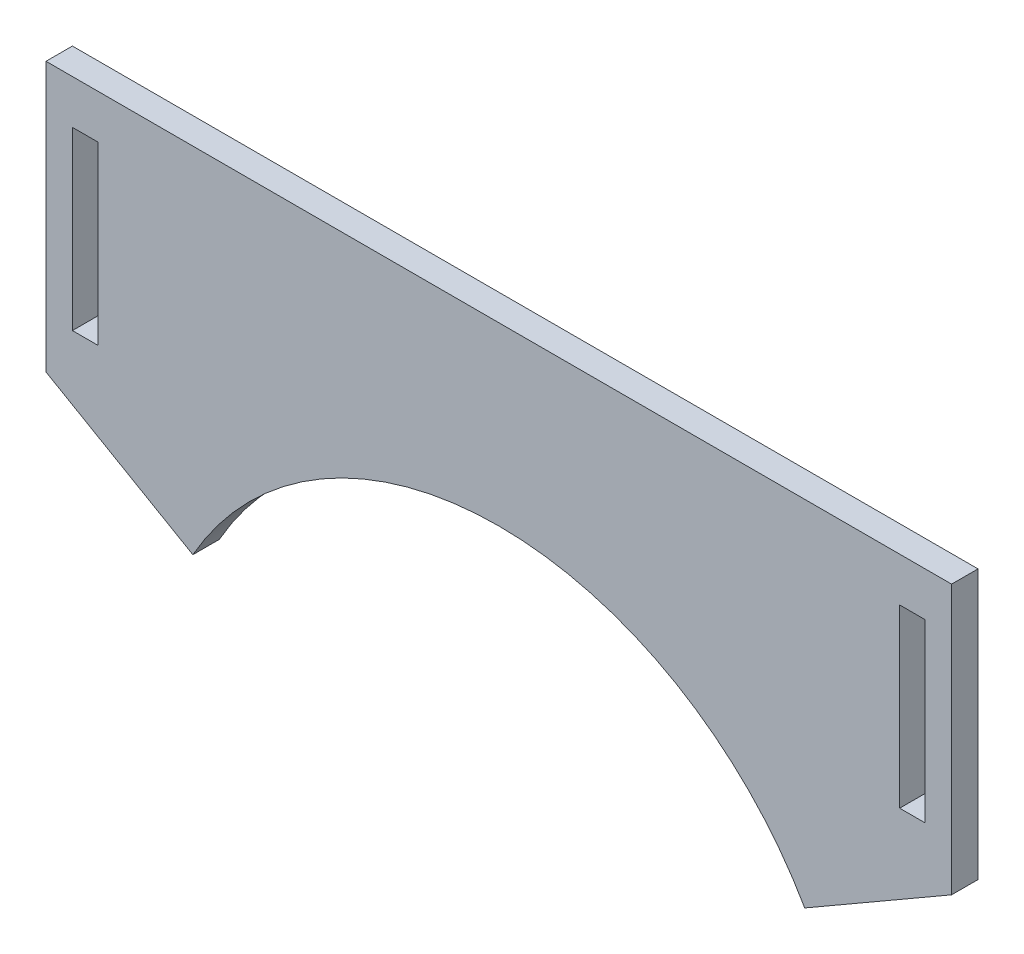
ISO-10303-21;
HEADER;
FILE_DESCRIPTION(('STEP AP214'),'2;1');
FILE_NAME('part.step','',(''),(''),'','','');
FILE_SCHEMA(('AUTOMOTIVE_DESIGN { 1 0 10303 214 1 1 1 1 }'));
ENDSEC;
DATA;
#1=APPLICATION_CONTEXT('core data for automotive mechanical design processes');
#2=APPLICATION_PROTOCOL_DEFINITION('international standard','automotive_design',2000,#1);
#3=PRODUCT_CONTEXT('',#1,'mechanical');
#4=PRODUCT('Part','Part','',(#3));
#5=PRODUCT_RELATED_PRODUCT_CATEGORY('part','',(#4));
#6=PRODUCT_DEFINITION_FORMATION('','',#4);
#7=PRODUCT_DEFINITION_CONTEXT('part definition',#1,'design');
#8=PRODUCT_DEFINITION('design','',#6,#7);
#9=PRODUCT_DEFINITION_SHAPE('','',#8);
#10=(LENGTH_UNIT() NAMED_UNIT(*) SI_UNIT(.MILLI.,.METRE.));
#11=(NAMED_UNIT(*) PLANE_ANGLE_UNIT() SI_UNIT($,.RADIAN.));
#12=(NAMED_UNIT(*) SI_UNIT($,.STERADIAN.) SOLID_ANGLE_UNIT());
#13=UNCERTAINTY_MEASURE_WITH_UNIT(LENGTH_MEASURE(1.E-05),#10,'distance_accuracy_value','');
#14=(GEOMETRIC_REPRESENTATION_CONTEXT(3) GLOBAL_UNCERTAINTY_ASSIGNED_CONTEXT((#13)) GLOBAL_UNIT_ASSIGNED_CONTEXT((#10,
#11,#12)) REPRESENTATION_CONTEXT('',''));
#15=CARTESIAN_POINT('',(0.,0.,0.));
#16=DIRECTION('',(0.,0.,1.));
#17=DIRECTION('',(1.,0.,0.));
#18=AXIS2_PLACEMENT_3D('',#15,#16,#17);
#19=CARTESIAN_POINT('',(52.45,-60.,3.));
#20=DIRECTION('',(0.,0.,1.));
#21=DIRECTION('',(1.,0.,0.));
#22=AXIS2_PLACEMENT_3D('',#19,#20,#21);
#23=PLANE('',#22);
#24=DIRECTION('',(0.,-1.,0.));
#25=VECTOR('',#24,1.);
#26=CARTESIAN_POINT('',(103.9,0.,3.));
#27=LINE('',#26,#25);
#28=CARTESIAN_POINT('',(103.9,0.,3.));
#29=VERTEX_POINT('',#28);
#30=CARTESIAN_POINT('',(103.9,-30.5773502691896,3.));
#31=VERTEX_POINT('',#30);
#32=EDGE_CURVE('E135',#29,#31,#27,.T.);
#33=ORIENTED_EDGE('',*,*,#32,.F.);
#34=DIRECTION('',(-1.,0.,0.));
#35=VECTOR('',#34,1.);
#36=CARTESIAN_POINT('',(0.,0.,3.));
#37=LINE('',#36,#35);
#38=CARTESIAN_POINT('',(1.,0.,3.));
#39=VERTEX_POINT('',#38);
#40=EDGE_CURVE('E55',#29,#39,#37,.T.);
#41=ORIENTED_EDGE('',*,*,#40,.T.);
#42=DIRECTION('',(0.,1.,0.));
#43=VECTOR('',#42,1.);
#44=CARTESIAN_POINT('',(1.,0.,3.));
#45=LINE('',#44,#43);
#46=CARTESIAN_POINT('',(1.,-30.5773502691896,3.));
#47=VERTEX_POINT('',#46);
#48=EDGE_CURVE('E140',#47,#39,#45,.T.);
#49=ORIENTED_EDGE('',*,*,#48,.F.);
#50=DIRECTION('',(0.86602540378444,-0.499999999999998,0.));
#51=VECTOR('',#50,1.);
#52=CARTESIAN_POINT('',(0.,-30.,3.));
#53=LINE('',#52,#51);
#54=CARTESIAN_POINT('',(17.687510664822,-40.2118890436293,3.));
#55=VERTEX_POINT('',#54);
#56=EDGE_CURVE('E158',#47,#55,#53,.T.);
#57=ORIENTED_EDGE('',*,*,#56,.T.);
#58=CARTESIAN_POINT('',(52.45,-60.,3.));
#59=DIRECTION('',(0.,0.,-1.));
#60=DIRECTION('',(1.,0.,0.));
#61=AXIS2_PLACEMENT_3D('',#58,#59,#60);
#62=CIRCLE('',#61,40.);
#63=CARTESIAN_POINT('',(87.212489335178,-40.2118890436293,3.));
#64=VERTEX_POINT('',#63);
#65=EDGE_CURVE('E165',#55,#64,#62,.T.);
#66=ORIENTED_EDGE('',*,*,#65,.T.);
#67=DIRECTION('',(0.86602540378444,0.499999999999998,0.));
#68=VECTOR('',#67,1.);
#69=CARTESIAN_POINT('',(104.9,-30.,3.));
#70=LINE('',#69,#68);
#71=EDGE_CURVE('E163',#64,#31,#70,.T.);
#72=ORIENTED_EDGE('',*,*,#71,.T.);
#73=EDGE_LOOP('',(#33,#41,#49,#57,#66,#72));
#74=FACE_BOUND('',#73,.T.);
#75=DIRECTION('',(1.,0.,0.));
#76=VECTOR('',#75,1.);
#77=CARTESIAN_POINT('',(98.0000000000001,-24.9999999999999,3.));
#78=LINE('',#77,#76);
#79=CARTESIAN_POINT('',(98.0000000000001,-24.9999999999999,3.));
#80=VERTEX_POINT('',#79);
#81=CARTESIAN_POINT('',(100.9,-24.9999999999999,3.));
#82=VERTEX_POINT('',#81);
#83=EDGE_CURVE('E234',#80,#82,#78,.T.);
#84=ORIENTED_EDGE('',*,*,#83,.F.);
#85=DIRECTION('',(0.,-1.,0.));
#86=VECTOR('',#85,1.);
#87=CARTESIAN_POINT('',(98.0000000000001,-5.,3.));
#88=LINE('',#87,#86);
#89=CARTESIAN_POINT('',(98.0000000000001,-5.,3.));
#90=VERTEX_POINT('',#89);
#91=EDGE_CURVE('E232',#90,#80,#88,.T.);
#92=ORIENTED_EDGE('',*,*,#91,.F.);
#93=DIRECTION('',(-1.,0.,0.));
#94=VECTOR('',#93,1.);
#95=CARTESIAN_POINT('',(98.0000000000001,-5.,3.));
#96=LINE('',#95,#94);
#97=CARTESIAN_POINT('',(100.9,-5.,3.));
#98=VERTEX_POINT('',#97);
#99=EDGE_CURVE('E240',#98,#90,#96,.T.);
#100=ORIENTED_EDGE('',*,*,#99,.F.);
#101=DIRECTION('',(0.,1.,0.));
#102=VECTOR('',#101,1.);
#103=CARTESIAN_POINT('',(100.9,-5.,3.));
#104=LINE('',#103,#102);
#105=EDGE_CURVE('E237',#82,#98,#104,.T.);
#106=ORIENTED_EDGE('',*,*,#105,.F.);
#107=EDGE_LOOP('',(#84,#92,#100,#106));
#108=FACE_BOUND('',#107,.T.);
#109=DIRECTION('',(1.,0.,0.));
#110=VECTOR('',#109,1.);
#111=CARTESIAN_POINT('',(4.,-25.,3.));
#112=LINE('',#111,#110);
#113=CARTESIAN_POINT('',(4.,-25.,3.));
#114=VERTEX_POINT('',#113);
#115=CARTESIAN_POINT('',(6.9,-25.,3.));
#116=VERTEX_POINT('',#115);
#117=EDGE_CURVE('E203',#114,#116,#112,.T.);
#118=ORIENTED_EDGE('',*,*,#117,.F.);
#119=DIRECTION('',(0.,-1.,0.));
#120=VECTOR('',#119,1.);
#121=CARTESIAN_POINT('',(4.,-5.,3.));
#122=LINE('',#121,#120);
#123=CARTESIAN_POINT('',(4.,-5.,3.));
#124=VERTEX_POINT('',#123);
#125=EDGE_CURVE('E201',#124,#114,#122,.T.);
#126=ORIENTED_EDGE('',*,*,#125,.F.);
#127=DIRECTION('',(-1.,0.,0.));
#128=VECTOR('',#127,1.);
#129=CARTESIAN_POINT('',(4.,-5.,3.));
#130=LINE('',#129,#128);
#131=CARTESIAN_POINT('',(6.9,-5.,3.));
#132=VERTEX_POINT('',#131);
#133=EDGE_CURVE('E209',#132,#124,#130,.T.);
#134=ORIENTED_EDGE('',*,*,#133,.F.);
#135=DIRECTION('',(0.,1.,0.));
#136=VECTOR('',#135,1.);
#137=CARTESIAN_POINT('',(6.9,-5.,3.));
#138=LINE('',#137,#136);
#139=EDGE_CURVE('E206',#116,#132,#138,.T.);
#140=ORIENTED_EDGE('',*,*,#139,.F.);
#141=EDGE_LOOP('',(#118,#126,#134,#140));
#142=FACE_BOUND('',#141,.T.);
#143=ADVANCED_FACE('F32',(#74,#108,#142),#23,.T.);
#144=CARTESIAN_POINT('',(52.45,-60.,0.));
#145=DIRECTION('',(0.,0.,1.));
#146=DIRECTION('',(1.,0.,0.));
#147=AXIS2_PLACEMENT_3D('',#144,#145,#146);
#148=PLANE('',#147);
#149=DIRECTION('',(0.,-1.,0.));
#150=VECTOR('',#149,1.);
#151=CARTESIAN_POINT('',(98.0000000000001,-5.,0.));
#152=LINE('',#151,#150);
#153=CARTESIAN_POINT('',(98.0000000000001,-5.,0.));
#154=VERTEX_POINT('',#153);
#155=CARTESIAN_POINT('',(98.0000000000001,-24.9999999999999,0.));
#156=VERTEX_POINT('',#155);
#157=EDGE_CURVE('E231',#154,#156,#152,.T.);
#158=ORIENTED_EDGE('',*,*,#157,.T.);
#159=DIRECTION('',(1.,0.,0.));
#160=VECTOR('',#159,1.);
#161=CARTESIAN_POINT('',(98.0000000000001,-24.9999999999999,0.));
#162=LINE('',#161,#160);
#163=CARTESIAN_POINT('',(100.9,-24.9999999999999,0.));
#164=VERTEX_POINT('',#163);
#165=EDGE_CURVE('E244',#156,#164,#162,.T.);
#166=ORIENTED_EDGE('',*,*,#165,.T.);
#167=DIRECTION('',(0.,1.,0.));
#168=VECTOR('',#167,1.);
#169=CARTESIAN_POINT('',(100.9,-5.,0.));
#170=LINE('',#169,#168);
#171=CARTESIAN_POINT('',(100.9,-5.,0.));
#172=VERTEX_POINT('',#171);
#173=EDGE_CURVE('E247',#164,#172,#170,.T.);
#174=ORIENTED_EDGE('',*,*,#173,.T.);
#175=DIRECTION('',(-1.,0.,0.));
#176=VECTOR('',#175,1.);
#177=CARTESIAN_POINT('',(98.0000000000001,-5.,0.));
#178=LINE('',#177,#176);
#179=EDGE_CURVE('E235',#172,#154,#178,.T.);
#180=ORIENTED_EDGE('',*,*,#179,.T.);
#181=EDGE_LOOP('',(#158,#166,#174,#180));
#182=FACE_BOUND('',#181,.T.);
#183=DIRECTION('',(-1.,0.,0.));
#184=VECTOR('',#183,1.);
#185=CARTESIAN_POINT('',(0.,0.,0.));
#186=LINE('',#185,#184);
#187=CARTESIAN_POINT('',(103.9,0.,0.));
#188=VERTEX_POINT('',#187);
#189=CARTESIAN_POINT('',(1.,0.,0.));
#190=VERTEX_POINT('',#189);
#191=EDGE_CURVE('E151',#188,#190,#186,.T.);
#192=ORIENTED_EDGE('',*,*,#191,.F.);
#193=DIRECTION('',(0.,-1.,0.));
#194=VECTOR('',#193,1.);
#195=CARTESIAN_POINT('',(103.9,0.,0.));
#196=LINE('',#195,#194);
#197=CARTESIAN_POINT('',(103.9,-30.5773502691896,0.));
#198=VERTEX_POINT('',#197);
#199=EDGE_CURVE('E47',#188,#198,#196,.T.);
#200=ORIENTED_EDGE('',*,*,#199,.T.);
#201=DIRECTION('',(0.86602540378444,0.499999999999998,0.));
#202=VECTOR('',#201,1.);
#203=CARTESIAN_POINT('',(104.9,-30.,0.));
#204=LINE('',#203,#202);
#205=CARTESIAN_POINT('',(87.212489335178,-40.2118890436293,0.));
#206=VERTEX_POINT('',#205);
#207=EDGE_CURVE('E149',#206,#198,#204,.T.);
#208=ORIENTED_EDGE('',*,*,#207,.F.);
#209=CARTESIAN_POINT('',(52.45,-60.,0.));
#210=DIRECTION('',(0.,0.,-1.));
#211=DIRECTION('',(1.,0.,0.));
#212=AXIS2_PLACEMENT_3D('',#209,#210,#211);
#213=CIRCLE('',#212,40.);
#214=CARTESIAN_POINT('',(17.687510664822,-40.2118890436293,0.));
#215=VERTEX_POINT('',#214);
#216=EDGE_CURVE('E156',#215,#206,#213,.T.);
#217=ORIENTED_EDGE('',*,*,#216,.F.);
#218=DIRECTION('',(0.86602540378444,-0.499999999999998,0.));
#219=VECTOR('',#218,1.);
#220=CARTESIAN_POINT('',(0.,-30.,0.));
#221=LINE('',#220,#219);
#222=CARTESIAN_POINT('',(1.,-30.5773502691896,0.));
#223=VERTEX_POINT('',#222);
#224=EDGE_CURVE('E160',#223,#215,#221,.T.);
#225=ORIENTED_EDGE('',*,*,#224,.F.);
#226=DIRECTION('',(0.,1.,0.));
#227=VECTOR('',#226,1.);
#228=CARTESIAN_POINT('',(1.,0.,0.));
#229=LINE('',#228,#227);
#230=EDGE_CURVE('E188',#223,#190,#229,.T.);
#231=ORIENTED_EDGE('',*,*,#230,.T.);
#232=EDGE_LOOP('',(#192,#200,#208,#217,#225,#231));
#233=FACE_BOUND('',#232,.T.);
#234=DIRECTION('',(0.,-1.,0.));
#235=VECTOR('',#234,1.);
#236=CARTESIAN_POINT('',(4.,-5.,0.));
#237=LINE('',#236,#235);
#238=CARTESIAN_POINT('',(4.,-5.,0.));
#239=VERTEX_POINT('',#238);
#240=CARTESIAN_POINT('',(4.,-25.,0.));
#241=VERTEX_POINT('',#240);
#242=EDGE_CURVE('E199',#239,#241,#237,.T.);
#243=ORIENTED_EDGE('',*,*,#242,.T.);
#244=DIRECTION('',(1.,0.,0.));
#245=VECTOR('',#244,1.);
#246=CARTESIAN_POINT('',(4.,-25.,0.));
#247=LINE('',#246,#245);
#248=CARTESIAN_POINT('',(6.9,-25.,0.));
#249=VERTEX_POINT('',#248);
#250=EDGE_CURVE('E214',#241,#249,#247,.T.);
#251=ORIENTED_EDGE('',*,*,#250,.T.);
#252=DIRECTION('',(0.,1.,0.));
#253=VECTOR('',#252,1.);
#254=CARTESIAN_POINT('',(6.9,-5.,0.));
#255=LINE('',#254,#253);
#256=CARTESIAN_POINT('',(6.9,-5.,0.));
#257=VERTEX_POINT('',#256);
#258=EDGE_CURVE('E217',#249,#257,#255,.T.);
#259=ORIENTED_EDGE('',*,*,#258,.T.);
#260=DIRECTION('',(-1.,0.,0.));
#261=VECTOR('',#260,1.);
#262=CARTESIAN_POINT('',(4.,-5.,0.));
#263=LINE('',#262,#261);
#264=EDGE_CURVE('E204',#257,#239,#263,.T.);
#265=ORIENTED_EDGE('',*,*,#264,.T.);
#266=EDGE_LOOP('',(#243,#251,#259,#265));
#267=FACE_BOUND('',#266,.T.);
#268=ADVANCED_FACE('F146',(#182,#233,#267),#148,.F.);
#269=CARTESIAN_POINT('',(0.,-30.,3.));
#270=DIRECTION('',(0.499999999999997,0.86602540378444,0.));
#271=DIRECTION('',(-0.86602540378444,0.499999999999998,0.));
#272=AXIS2_PLACEMENT_3D('',#269,#270,#271);
#273=PLANE('',#272);
#274=ORIENTED_EDGE('',*,*,#56,.F.);
#275=DIRECTION('',(0.,0.,1.));
#276=VECTOR('',#275,1.);
#277=CARTESIAN_POINT('',(1.,-30.5773502691896,0.));
#278=LINE('',#277,#276);
#279=EDGE_CURVE('E191',#223,#47,#278,.T.);
#280=ORIENTED_EDGE('',*,*,#279,.F.);
#281=ORIENTED_EDGE('',*,*,#224,.T.);
#282=DIRECTION('',(0.,0.,-1.));
#283=VECTOR('',#282,1.);
#284=CARTESIAN_POINT('',(17.687510664822,-40.2118890436293,3.));
#285=LINE('',#284,#283);
#286=EDGE_CURVE('E11',#55,#215,#285,.T.);
#287=ORIENTED_EDGE('',*,*,#286,.F.);
#288=EDGE_LOOP('',(#274,#280,#281,#287));
#289=FACE_BOUND('',#288,.T.);
#290=ADVANCED_FACE('F34',(#289),#273,.F.);
#291=CARTESIAN_POINT('',(52.45,-60.,3.));
#292=DIRECTION('',(0.,0.,-1.));
#293=DIRECTION('',(-1.,0.,0.));
#294=AXIS2_PLACEMENT_3D('',#291,#292,#293);
#295=CYLINDRICAL_SURFACE('',#294,40.);
#296=ORIENTED_EDGE('',*,*,#216,.T.);
#297=DIRECTION('',(0.,0.,-1.));
#298=VECTOR('',#297,1.);
#299=CARTESIAN_POINT('',(87.212489335178,-40.2118890436293,3.));
#300=LINE('',#299,#298);
#301=EDGE_CURVE('E40',#64,#206,#300,.T.);
#302=ORIENTED_EDGE('',*,*,#301,.F.);
#303=ORIENTED_EDGE('',*,*,#65,.F.);
#304=ORIENTED_EDGE('',*,*,#286,.T.);
#305=EDGE_LOOP('',(#296,#302,#303,#304));
#306=FACE_BOUND('',#305,.T.);
#307=ADVANCED_FACE('F187',(#306),#295,.F.);
#308=CARTESIAN_POINT('',(104.9,-30.,3.));
#309=DIRECTION('',(-0.499999999999998,0.86602540378444,0.));
#310=DIRECTION('',(-0.86602540378444,-0.499999999999998,0.));
#311=AXIS2_PLACEMENT_3D('',#308,#309,#310);
#312=PLANE('',#311);
#313=ORIENTED_EDGE('',*,*,#207,.T.);
#314=DIRECTION('',(0.,0.,1.));
#315=VECTOR('',#314,1.);
#316=CARTESIAN_POINT('',(103.9,-30.5773502691896,0.));
#317=LINE('',#316,#315);
#318=EDGE_CURVE('E133',#198,#31,#317,.T.);
#319=ORIENTED_EDGE('',*,*,#318,.T.);
#320=ORIENTED_EDGE('',*,*,#71,.F.);
#321=ORIENTED_EDGE('',*,*,#301,.T.);
#322=EDGE_LOOP('',(#313,#319,#320,#321));
#323=FACE_BOUND('',#322,.T.);
#324=ADVANCED_FACE('F154',(#323),#312,.F.);
#325=CARTESIAN_POINT('',(0.,0.,3.));
#326=DIRECTION('',(0.,-1.,0.));
#327=DIRECTION('',(0.,0.,-1.));
#328=AXIS2_PLACEMENT_3D('',#325,#326,#327);
#329=PLANE('',#328);
#330=ORIENTED_EDGE('',*,*,#40,.F.);
#331=DIRECTION('',(0.,0.,1.));
#332=VECTOR('',#331,1.);
#333=CARTESIAN_POINT('',(103.9,0.,0.));
#334=LINE('',#333,#332);
#335=EDGE_CURVE('E141',#188,#29,#334,.T.);
#336=ORIENTED_EDGE('',*,*,#335,.F.);
#337=ORIENTED_EDGE('',*,*,#191,.T.);
#338=DIRECTION('',(0.,0.,1.));
#339=VECTOR('',#338,1.);
#340=CARTESIAN_POINT('',(1.,0.,0.));
#341=LINE('',#340,#339);
#342=EDGE_CURVE('E193',#190,#39,#341,.T.);
#343=ORIENTED_EDGE('',*,*,#342,.T.);
#344=EDGE_LOOP('',(#330,#336,#337,#343));
#345=FACE_BOUND('',#344,.T.);
#346=ADVANCED_FACE('F271',(#345),#329,.F.);
#347=CARTESIAN_POINT('',(98.0000000000001,-5.,3.));
#348=DIRECTION('',(1.,0.,0.));
#349=DIRECTION('',(0.,0.,-1.));
#350=AXIS2_PLACEMENT_3D('',#347,#348,#349);
#351=PLANE('',#350);
#352=ORIENTED_EDGE('',*,*,#157,.F.);
#353=DIRECTION('',(0.,0.,-1.));
#354=VECTOR('',#353,1.);
#355=CARTESIAN_POINT('',(98.0000000000001,-5.,3.));
#356=LINE('',#355,#354);
#357=EDGE_CURVE('E242',#90,#154,#356,.T.);
#358=ORIENTED_EDGE('',*,*,#357,.F.);
#359=ORIENTED_EDGE('',*,*,#91,.T.);
#360=DIRECTION('',(0.,0.,-1.));
#361=VECTOR('',#360,1.);
#362=CARTESIAN_POINT('',(98.0000000000001,-24.9999999999999,3.));
#363=LINE('',#362,#361);
#364=EDGE_CURVE('E168',#80,#156,#363,.T.);
#365=ORIENTED_EDGE('',*,*,#364,.T.);
#366=EDGE_LOOP('',(#352,#358,#359,#365));
#367=FACE_BOUND('',#366,.T.);
#368=ADVANCED_FACE('F269',(#367),#351,.T.);
#369=CARTESIAN_POINT('',(98.0000000000001,-24.9999999999999,3.));
#370=DIRECTION('',(0.,1.,0.));
#371=DIRECTION('',(0.,0.,1.));
#372=AXIS2_PLACEMENT_3D('',#369,#370,#371);
#373=PLANE('',#372);
#374=ORIENTED_EDGE('',*,*,#165,.F.);
#375=ORIENTED_EDGE('',*,*,#364,.F.);
#376=ORIENTED_EDGE('',*,*,#83,.T.);
#377=DIRECTION('',(0.,0.,-1.));
#378=VECTOR('',#377,1.);
#379=CARTESIAN_POINT('',(100.9,-24.9999999999999,3.));
#380=LINE('',#379,#378);
#381=EDGE_CURVE('E174',#82,#164,#380,.T.);
#382=ORIENTED_EDGE('',*,*,#381,.T.);
#383=EDGE_LOOP('',(#374,#375,#376,#382));
#384=FACE_BOUND('',#383,.T.);
#385=ADVANCED_FACE('F265',(#384),#373,.T.);
#386=CARTESIAN_POINT('',(100.9,-5.,3.));
#387=DIRECTION('',(-1.,0.,0.));
#388=DIRECTION('',(0.,0.,1.));
#389=AXIS2_PLACEMENT_3D('',#386,#387,#388);
#390=PLANE('',#389);
#391=ORIENTED_EDGE('',*,*,#173,.F.);
#392=ORIENTED_EDGE('',*,*,#381,.F.);
#393=ORIENTED_EDGE('',*,*,#105,.T.);
#394=DIRECTION('',(0.,0.,-1.));
#395=VECTOR('',#394,1.);
#396=CARTESIAN_POINT('',(100.9,-5.,3.));
#397=LINE('',#396,#395);
#398=EDGE_CURVE('E179',#98,#172,#397,.T.);
#399=ORIENTED_EDGE('',*,*,#398,.T.);
#400=EDGE_LOOP('',(#391,#392,#393,#399));
#401=FACE_BOUND('',#400,.T.);
#402=ADVANCED_FACE('F256',(#401),#390,.T.);
#403=CARTESIAN_POINT('',(98.0000000000001,-5.,3.));
#404=DIRECTION('',(0.,-1.,0.));
#405=DIRECTION('',(0.,0.,-1.));
#406=AXIS2_PLACEMENT_3D('',#403,#404,#405);
#407=PLANE('',#406);
#408=ORIENTED_EDGE('',*,*,#179,.F.);
#409=ORIENTED_EDGE('',*,*,#398,.F.);
#410=ORIENTED_EDGE('',*,*,#99,.T.);
#411=ORIENTED_EDGE('',*,*,#357,.T.);
#412=EDGE_LOOP('',(#408,#409,#410,#411));
#413=FACE_BOUND('',#412,.T.);
#414=ADVANCED_FACE('F261',(#413),#407,.T.);
#415=CARTESIAN_POINT('',(4.,-5.,3.));
#416=DIRECTION('',(1.,0.,0.));
#417=DIRECTION('',(0.,1.,0.));
#418=AXIS2_PLACEMENT_3D('',#415,#416,#417);
#419=PLANE('',#418);
#420=ORIENTED_EDGE('',*,*,#242,.F.);
#421=DIRECTION('',(0.,0.,-1.));
#422=VECTOR('',#421,1.);
#423=CARTESIAN_POINT('',(4.,-5.,3.));
#424=LINE('',#423,#422);
#425=EDGE_CURVE('E211',#124,#239,#424,.T.);
#426=ORIENTED_EDGE('',*,*,#425,.F.);
#427=ORIENTED_EDGE('',*,*,#125,.T.);
#428=DIRECTION('',(0.,0.,-1.));
#429=VECTOR('',#428,1.);
#430=CARTESIAN_POINT('',(4.,-25.,3.));
#431=LINE('',#430,#429);
#432=EDGE_CURVE('E228',#114,#241,#431,.T.);
#433=ORIENTED_EDGE('',*,*,#432,.T.);
#434=EDGE_LOOP('',(#420,#426,#427,#433));
#435=FACE_BOUND('',#434,.T.);
#436=ADVANCED_FACE('F314',(#435),#419,.T.);
#437=CARTESIAN_POINT('',(4.,-25.,3.));
#438=DIRECTION('',(0.,1.,0.));
#439=DIRECTION('',(-1.,0.,0.));
#440=AXIS2_PLACEMENT_3D('',#437,#438,#439);
#441=PLANE('',#440);
#442=ORIENTED_EDGE('',*,*,#250,.F.);
#443=ORIENTED_EDGE('',*,*,#432,.F.);
#444=ORIENTED_EDGE('',*,*,#117,.T.);
#445=DIRECTION('',(0.,0.,-1.));
#446=VECTOR('',#445,1.);
#447=CARTESIAN_POINT('',(6.9,-25.,3.));
#448=LINE('',#447,#446);
#449=EDGE_CURVE('E226',#116,#249,#448,.T.);
#450=ORIENTED_EDGE('',*,*,#449,.T.);
#451=EDGE_LOOP('',(#442,#443,#444,#450));
#452=FACE_BOUND('',#451,.T.);
#453=ADVANCED_FACE('F310',(#452),#441,.T.);
#454=CARTESIAN_POINT('',(6.9,-5.,3.));
#455=DIRECTION('',(-1.,0.,0.));
#456=DIRECTION('',(0.,-1.,0.));
#457=AXIS2_PLACEMENT_3D('',#454,#455,#456);
#458=PLANE('',#457);
#459=ORIENTED_EDGE('',*,*,#258,.F.);
#460=ORIENTED_EDGE('',*,*,#449,.F.);
#461=ORIENTED_EDGE('',*,*,#139,.T.);
#462=DIRECTION('',(0.,0.,-1.));
#463=VECTOR('',#462,1.);
#464=CARTESIAN_POINT('',(6.9,-5.,3.));
#465=LINE('',#464,#463);
#466=EDGE_CURVE('E224',#132,#257,#465,.T.);
#467=ORIENTED_EDGE('',*,*,#466,.T.);
#468=EDGE_LOOP('',(#459,#460,#461,#467));
#469=FACE_BOUND('',#468,.T.);
#470=ADVANCED_FACE('F304',(#469),#458,.T.);
#471=CARTESIAN_POINT('',(4.,-5.,3.));
#472=DIRECTION('',(0.,-1.,0.));
#473=DIRECTION('',(0.,0.,-1.));
#474=AXIS2_PLACEMENT_3D('',#471,#472,#473);
#475=PLANE('',#474);
#476=ORIENTED_EDGE('',*,*,#264,.F.);
#477=ORIENTED_EDGE('',*,*,#466,.F.);
#478=ORIENTED_EDGE('',*,*,#133,.T.);
#479=ORIENTED_EDGE('',*,*,#425,.T.);
#480=EDGE_LOOP('',(#476,#477,#478,#479));
#481=FACE_BOUND('',#480,.T.);
#482=ADVANCED_FACE('F297',(#481),#475,.T.);
#483=CARTESIAN_POINT('',(1.,0.,0.));
#484=DIRECTION('',(1.,0.,0.));
#485=DIRECTION('',(0.,1.,0.));
#486=AXIS2_PLACEMENT_3D('',#483,#484,#485);
#487=PLANE('',#486);
#488=ORIENTED_EDGE('',*,*,#48,.T.);
#489=ORIENTED_EDGE('',*,*,#342,.F.);
#490=ORIENTED_EDGE('',*,*,#230,.F.);
#491=ORIENTED_EDGE('',*,*,#279,.T.);
#492=EDGE_LOOP('',(#488,#489,#490,#491));
#493=FACE_BOUND('',#492,.T.);
#494=ADVANCED_FACE('F294',(#493),#487,.F.);
#495=CARTESIAN_POINT('',(103.9,0.,0.));
#496=DIRECTION('',(-1.,0.,0.));
#497=DIRECTION('',(0.,0.,1.));
#498=AXIS2_PLACEMENT_3D('',#495,#496,#497);
#499=PLANE('',#498);
#500=ORIENTED_EDGE('',*,*,#32,.T.);
#501=ORIENTED_EDGE('',*,*,#318,.F.);
#502=ORIENTED_EDGE('',*,*,#199,.F.);
#503=ORIENTED_EDGE('',*,*,#335,.T.);
#504=EDGE_LOOP('',(#500,#501,#502,#503));
#505=FACE_BOUND('',#504,.T.);
#506=ADVANCED_FACE('F134',(#505),#499,.F.);
#507=CLOSED_SHELL('',(#143,#268,#290,#307,#324,#346,#368,#385,#402,#414,#436,#453,#470,#482,
#494,#506));
#508=MANIFOLD_SOLID_BREP('B2',#507);
#509=ADVANCED_BREP_SHAPE_REPRESENTATION('',(#18,#508),#14);
#510=SHAPE_DEFINITION_REPRESENTATION(#9,#509);
ENDSEC;
END-ISO-10303-21;
